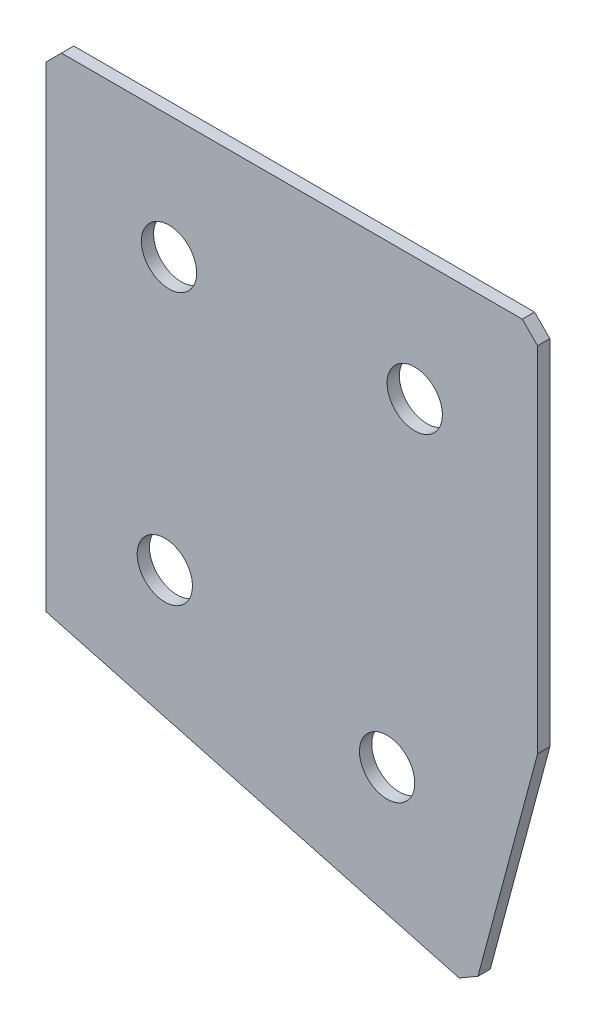
ISO-10303-21;
HEADER;
FILE_DESCRIPTION(('STEP AP214'),'2;1');
FILE_NAME('part.step','',(''),(''),'','','');
FILE_SCHEMA(('AUTOMOTIVE_DESIGN { 1 0 10303 214 1 1 1 1 }'));
ENDSEC;
DATA;
#1=APPLICATION_CONTEXT('core data for automotive mechanical design processes');
#2=APPLICATION_PROTOCOL_DEFINITION('international standard','automotive_design',2000,#1);
#3=PRODUCT_CONTEXT('',#1,'mechanical');
#4=PRODUCT('Part','Part','',(#3));
#5=PRODUCT_RELATED_PRODUCT_CATEGORY('part','',(#4));
#6=PRODUCT_DEFINITION_FORMATION('','',#4);
#7=PRODUCT_DEFINITION_CONTEXT('part definition',#1,'design');
#8=PRODUCT_DEFINITION('design','',#6,#7);
#9=PRODUCT_DEFINITION_SHAPE('','',#8);
#10=(LENGTH_UNIT() NAMED_UNIT(*) SI_UNIT(.MILLI.,.METRE.));
#11=(NAMED_UNIT(*) PLANE_ANGLE_UNIT() SI_UNIT($,.RADIAN.));
#12=(NAMED_UNIT(*) SI_UNIT($,.STERADIAN.) SOLID_ANGLE_UNIT());
#13=UNCERTAINTY_MEASURE_WITH_UNIT(LENGTH_MEASURE(1.E-05),#10,'distance_accuracy_value','');
#14=(GEOMETRIC_REPRESENTATION_CONTEXT(3) GLOBAL_UNCERTAINTY_ASSIGNED_CONTEXT((#13)) GLOBAL_UNIT_ASSIGNED_CONTEXT((#10,
#11,#12)) REPRESENTATION_CONTEXT('',''));
#15=CARTESIAN_POINT('',(0.,0.,0.));
#16=DIRECTION('',(0.,0.,1.));
#17=DIRECTION('',(1.,0.,0.));
#18=AXIS2_PLACEMENT_3D('',#15,#16,#17);
#19=CARTESIAN_POINT('',(0.,0.,-2.));
#20=DIRECTION('',(1.,0.,0.));
#21=DIRECTION('',(0.,0.,-1.));
#22=AXIS2_PLACEMENT_3D('',#19,#20,#21);
#23=PLANE('',#22);
#24=DIRECTION('',(0.,1.,0.));
#25=VECTOR('',#24,1.);
#26=CARTESIAN_POINT('',(0.,0.,0.));
#27=LINE('',#26,#25);
#28=CARTESIAN_POINT('',(0.,-80.,0.));
#29=VERTEX_POINT('',#28);
#30=CARTESIAN_POINT('',(0.,-2.5,0.));
#31=VERTEX_POINT('',#30);
#32=EDGE_CURVE('E130',#29,#31,#27,.T.);
#33=ORIENTED_EDGE('',*,*,#32,.T.);
#34=DIRECTION('',(0.,0.,-1.));
#35=VECTOR('',#34,1.);
#36=CARTESIAN_POINT('',(0.,-2.5,-2.));
#37=LINE('',#36,#35);
#38=CARTESIAN_POINT('',(0.,-2.5,-2.));
#39=VERTEX_POINT('',#38);
#40=EDGE_CURVE('E11',#31,#39,#37,.T.);
#41=ORIENTED_EDGE('',*,*,#40,.T.);
#42=DIRECTION('',(0.,1.,0.));
#43=VECTOR('',#42,1.);
#44=CARTESIAN_POINT('',(0.,0.,-2.));
#45=LINE('',#44,#43);
#46=CARTESIAN_POINT('',(0.,-80.,-2.));
#47=VERTEX_POINT('',#46);
#48=EDGE_CURVE('E141',#47,#39,#45,.T.);
#49=ORIENTED_EDGE('',*,*,#48,.F.);
#50=DIRECTION('',(0.,0.,1.));
#51=VECTOR('',#50,1.);
#52=CARTESIAN_POINT('',(0.,-80.,-2.));
#53=LINE('',#52,#51);
#54=EDGE_CURVE('E120',#47,#29,#53,.T.);
#55=ORIENTED_EDGE('',*,*,#54,.T.);
#56=EDGE_LOOP('',(#33,#41,#49,#55));
#57=FACE_BOUND('',#56,.T.);
#58=ADVANCED_FACE('F37',(#57),#23,.F.);
#59=CARTESIAN_POINT('',(0.,0.,-2.));
#60=DIRECTION('',(0.,-1.,0.));
#61=DIRECTION('',(0.,0.,-1.));
#62=AXIS2_PLACEMENT_3D('',#59,#60,#61);
#63=PLANE('',#62);
#64=DIRECTION('',(1.,0.,0.));
#65=VECTOR('',#64,1.);
#66=CARTESIAN_POINT('',(0.,0.,0.));
#67=LINE('',#66,#65);
#68=CARTESIAN_POINT('',(2.5,0.,0.));
#69=VERTEX_POINT('',#68);
#70=CARTESIAN_POINT('',(77.5,0.,0.));
#71=VERTEX_POINT('',#70);
#72=EDGE_CURVE('E133',#69,#71,#67,.T.);
#73=ORIENTED_EDGE('',*,*,#72,.T.);
#74=DIRECTION('',(0.,0.,-1.));
#75=VECTOR('',#74,1.);
#76=CARTESIAN_POINT('',(77.5,0.,-2.));
#77=LINE('',#76,#75);
#78=CARTESIAN_POINT('',(77.5,0.,-2.));
#79=VERTEX_POINT('',#78);
#80=EDGE_CURVE('E45',#71,#79,#77,.T.);
#81=ORIENTED_EDGE('',*,*,#80,.T.);
#82=DIRECTION('',(1.,0.,0.));
#83=VECTOR('',#82,1.);
#84=CARTESIAN_POINT('',(0.,0.,-2.));
#85=LINE('',#84,#83);
#86=CARTESIAN_POINT('',(2.5,0.,-2.));
#87=VERTEX_POINT('',#86);
#88=EDGE_CURVE('E109',#87,#79,#85,.T.);
#89=ORIENTED_EDGE('',*,*,#88,.F.);
#90=DIRECTION('',(0.,0.,1.));
#91=VECTOR('',#90,1.);
#92=CARTESIAN_POINT('',(2.5,0.,-2.));
#93=LINE('',#92,#91);
#94=EDGE_CURVE('E160',#87,#69,#93,.T.);
#95=ORIENTED_EDGE('',*,*,#94,.T.);
#96=EDGE_LOOP('',(#73,#81,#89,#95));
#97=FACE_BOUND('',#96,.T.);
#98=ADVANCED_FACE('F164',(#97),#63,.F.);
#99=CARTESIAN_POINT('',(80.,0.,-2.));
#100=DIRECTION('',(-1.,0.,0.));
#101=DIRECTION('',(0.,0.,1.));
#102=AXIS2_PLACEMENT_3D('',#99,#100,#101);
#103=PLANE('',#102);
#104=DIRECTION('',(0.,-1.,0.));
#105=VECTOR('',#104,1.);
#106=CARTESIAN_POINT('',(80.,0.,-2.));
#107=LINE('',#106,#105);
#108=CARTESIAN_POINT('',(80.,-2.50000000000003,-2.));
#109=VERTEX_POINT('',#108);
#110=CARTESIAN_POINT('',(80.,-60.0248881780866,-2.));
#111=VERTEX_POINT('',#110);
#112=EDGE_CURVE('E100',#109,#111,#107,.T.);
#113=ORIENTED_EDGE('',*,*,#112,.F.);
#114=DIRECTION('',(0.,0.,1.));
#115=VECTOR('',#114,1.);
#116=CARTESIAN_POINT('',(80.,-2.50000000000003,-2.));
#117=LINE('',#116,#115);
#118=CARTESIAN_POINT('',(80.,-2.50000000000003,0.));
#119=VERTEX_POINT('',#118);
#120=EDGE_CURVE('E158',#109,#119,#117,.T.);
#121=ORIENTED_EDGE('',*,*,#120,.T.);
#122=DIRECTION('',(0.,-1.,0.));
#123=VECTOR('',#122,1.);
#124=CARTESIAN_POINT('',(80.,0.,0.));
#125=LINE('',#124,#123);
#126=CARTESIAN_POINT('',(80.,-60.0248881780866,0.));
#127=VERTEX_POINT('',#126);
#128=EDGE_CURVE('E115',#119,#127,#125,.T.);
#129=ORIENTED_EDGE('',*,*,#128,.T.);
#130=DIRECTION('',(0.,0.,1.));
#131=VECTOR('',#130,1.);
#132=CARTESIAN_POINT('',(80.,-60.0248881780866,-2.));
#133=LINE('',#132,#131);
#134=EDGE_CURVE('E112',#111,#127,#133,.T.);
#135=ORIENTED_EDGE('',*,*,#134,.F.);
#136=EDGE_LOOP('',(#113,#121,#129,#135));
#137=FACE_BOUND('',#136,.T.);
#138=ADVANCED_FACE('F113',(#137),#103,.F.);
#139=CARTESIAN_POINT('',(69.6472381958991,-98.6619212296493,-2.));
#140=DIRECTION('',(-0.965925826289068,0.258819045102522,0.));
#141=DIRECTION('',(-0.258819045102522,-0.965925826289068,0.));
#142=AXIS2_PLACEMENT_3D('',#139,#140,#141);
#143=PLANE('',#142);
#144=DIRECTION('',(-0.258819045102522,-0.965925826289068,0.));
#145=VECTOR('',#144,1.);
#146=CARTESIAN_POINT('',(69.6472381958991,-98.6619212296493,0.));
#147=LINE('',#146,#145);
#148=CARTESIAN_POINT('',(70.2942858086554,-96.2471066639266,0.));
#149=VERTEX_POINT('',#148);
#150=EDGE_CURVE('E137',#127,#149,#147,.T.);
#151=ORIENTED_EDGE('',*,*,#150,.T.);
#152=DIRECTION('',(0.,0.,-1.));
#153=VECTOR('',#152,1.);
#154=CARTESIAN_POINT('',(70.2942858086554,-96.2471066639266,-2.));
#155=LINE('',#154,#153);
#156=CARTESIAN_POINT('',(70.2942858086554,-96.2471066639266,-2.));
#157=VERTEX_POINT('',#156);
#158=EDGE_CURVE('E124',#149,#157,#155,.T.);
#159=ORIENTED_EDGE('',*,*,#158,.T.);
#160=DIRECTION('',(-0.258819045102522,-0.965925826289068,0.));
#161=VECTOR('',#160,1.);
#162=CARTESIAN_POINT('',(69.6472381958991,-98.6619212296493,-2.));
#163=LINE('',#162,#161);
#164=EDGE_CURVE('E104',#111,#157,#163,.T.);
#165=ORIENTED_EDGE('',*,*,#164,.F.);
#166=ORIENTED_EDGE('',*,*,#134,.T.);
#167=EDGE_LOOP('',(#151,#159,#165,#166));
#168=FACE_BOUND('',#167,.T.);
#169=ADVANCED_FACE('F122',(#168),#143,.F.);
#170=CARTESIAN_POINT('',(0.,-80.,-2.));
#171=DIRECTION('',(0.258819045102521,0.965925826289068,0.));
#172=DIRECTION('',(-0.965925826289068,0.258819045102521,0.));
#173=AXIS2_PLACEMENT_3D('',#170,#171,#172);
#174=PLANE('',#173);
#175=DIRECTION('',(-0.965925826289068,0.258819045102521,0.));
#176=VECTOR('',#175,1.);
#177=CARTESIAN_POINT('',(0.,-80.,-2.));
#178=LINE('',#177,#176);
#179=CARTESIAN_POINT('',(67.2324236301764,-98.014873616893,-2.));
#180=VERTEX_POINT('',#179);
#181=EDGE_CURVE('E125',#180,#47,#178,.T.);
#182=ORIENTED_EDGE('',*,*,#181,.F.);
#183=DIRECTION('',(0.,0.,1.));
#184=VECTOR('',#183,1.);
#185=CARTESIAN_POINT('',(67.2324236301764,-98.014873616893,-2.));
#186=LINE('',#185,#184);
#187=CARTESIAN_POINT('',(67.2324236301764,-98.014873616893,0.));
#188=VERTEX_POINT('',#187);
#189=EDGE_CURVE('E119',#180,#188,#186,.T.);
#190=ORIENTED_EDGE('',*,*,#189,.T.);
#191=DIRECTION('',(-0.965925826289068,0.258819045102521,0.));
#192=VECTOR('',#191,1.);
#193=CARTESIAN_POINT('',(0.,-80.,0.));
#194=LINE('',#193,#192);
#195=EDGE_CURVE('E139',#188,#29,#194,.T.);
#196=ORIENTED_EDGE('',*,*,#195,.T.);
#197=ORIENTED_EDGE('',*,*,#54,.F.);
#198=EDGE_LOOP('',(#182,#190,#196,#197));
#199=FACE_BOUND('',#198,.T.);
#200=ADVANCED_FACE('F194',(#199),#174,.F.);
#201=CARTESIAN_POINT('',(0.,0.,-2.));
#202=DIRECTION('',(0.,0.,1.));
#203=DIRECTION('',(1.,0.,0.));
#204=AXIS2_PLACEMENT_3D('',#201,#202,#203);
#205=PLANE('',#204);
#206=CARTESIAN_POINT('',(20.,-20.,-2.));
#207=DIRECTION('',(0.,0.,-1.));
#208=DIRECTION('',(0.,1.,0.));
#209=AXIS2_PLACEMENT_3D('',#206,#207,#208);
#210=CIRCLE('',#209,4.5);
#211=CARTESIAN_POINT('',(20.,-15.5,-2.));
#212=VERTEX_POINT('',#211);
#213=EDGE_CURVE('E226',#212,#212,#210,.T.);
#214=ORIENTED_EDGE('',*,*,#213,.F.);
#215=EDGE_LOOP('',(#214));
#216=FACE_BOUND('',#215,.T.);
#217=CARTESIAN_POINT('',(60.,-20.,-2.));
#218=DIRECTION('',(0.,0.,-1.));
#219=DIRECTION('',(0.,1.,0.));
#220=AXIS2_PLACEMENT_3D('',#217,#218,#219);
#221=CIRCLE('',#220,4.5);
#222=CARTESIAN_POINT('',(60.,-15.5,-2.));
#223=VERTEX_POINT('',#222);
#224=EDGE_CURVE('E228',#223,#223,#221,.T.);
#225=ORIENTED_EDGE('',*,*,#224,.F.);
#226=EDGE_LOOP('',(#225));
#227=FACE_BOUND('',#226,.T.);
#228=CARTESIAN_POINT('',(19.3185165257814,-64.4708572938487,-2.));
#229=DIRECTION('',(0.,0.,-1.));
#230=DIRECTION('',(0.,1.,0.));
#231=AXIS2_PLACEMENT_3D('',#228,#229,#230);
#232=CIRCLE('',#231,4.5);
#233=CARTESIAN_POINT('',(19.3185165257814,-59.9708572938487,-2.));
#234=VERTEX_POINT('',#233);
#235=EDGE_CURVE('E236',#234,#234,#232,.T.);
#236=ORIENTED_EDGE('',*,*,#235,.F.);
#237=EDGE_LOOP('',(#236));
#238=FACE_BOUND('',#237,.T.);
#239=CARTESIAN_POINT('',(55.5051025721682,-74.1670238018175,-2.));
#240=DIRECTION('',(0.,0.,-1.));
#241=DIRECTION('',(0.,1.,0.));
#242=AXIS2_PLACEMENT_3D('',#239,#240,#241);
#243=CIRCLE('',#242,4.5);
#244=CARTESIAN_POINT('',(55.5051025721682,-69.6670238018175,-2.));
#245=VERTEX_POINT('',#244);
#246=EDGE_CURVE('E242',#245,#245,#243,.T.);
#247=ORIENTED_EDGE('',*,*,#246,.F.);
#248=EDGE_LOOP('',(#247));
#249=FACE_BOUND('',#248,.T.);
#250=ORIENTED_EDGE('',*,*,#164,.T.);
#251=DIRECTION('',(0.866025403784439,0.5,0.));
#252=VECTOR('',#251,1.);
#253=CARTESIAN_POINT('',(67.2324236301764,-98.014873616893,-2.));
#254=LINE('',#253,#252);
#255=EDGE_CURVE('E156',#157,#180,#254,.F.);
#256=ORIENTED_EDGE('',*,*,#255,.T.);
#257=ORIENTED_EDGE('',*,*,#181,.T.);
#258=ORIENTED_EDGE('',*,*,#48,.T.);
#259=DIRECTION('',(-0.707106781186548,-0.707106781186548,0.));
#260=VECTOR('',#259,1.);
#261=CARTESIAN_POINT('',(2.5,0.,-2.));
#262=LINE('',#261,#260);
#263=EDGE_CURVE('E153',#39,#87,#262,.F.);
#264=ORIENTED_EDGE('',*,*,#263,.T.);
#265=ORIENTED_EDGE('',*,*,#88,.T.);
#266=DIRECTION('',(-0.707106781186548,0.707106781186548,0.));
#267=VECTOR('',#266,1.);
#268=CARTESIAN_POINT('',(80.,-2.50000000000003,-2.));
#269=LINE('',#268,#267);
#270=EDGE_CURVE('E52',#79,#109,#269,.F.);
#271=ORIENTED_EDGE('',*,*,#270,.T.);
#272=ORIENTED_EDGE('',*,*,#112,.T.);
#273=EDGE_LOOP('',(#250,#256,#257,#258,#264,#265,#271,#272));
#274=FACE_BOUND('',#273,.T.);
#275=ADVANCED_FACE('F102',(#216,#227,#238,#249,#274),#205,.F.);
#276=CARTESIAN_POINT('',(0.,0.,0.));
#277=DIRECTION('',(0.,0.,1.));
#278=DIRECTION('',(1.,0.,0.));
#279=AXIS2_PLACEMENT_3D('',#276,#277,#278);
#280=PLANE('',#279);
#281=CARTESIAN_POINT('',(20.,-20.,0.));
#282=DIRECTION('',(0.,0.,-1.));
#283=DIRECTION('',(0.,1.,0.));
#284=AXIS2_PLACEMENT_3D('',#281,#282,#283);
#285=CIRCLE('',#284,4.5);
#286=CARTESIAN_POINT('',(20.,-15.5,0.));
#287=VERTEX_POINT('',#286);
#288=EDGE_CURVE('E223',#287,#287,#285,.T.);
#289=ORIENTED_EDGE('',*,*,#288,.T.);
#290=EDGE_LOOP('',(#289));
#291=FACE_BOUND('',#290,.T.);
#292=CARTESIAN_POINT('',(60.,-20.,0.));
#293=DIRECTION('',(0.,0.,-1.));
#294=DIRECTION('',(0.,1.,0.));
#295=AXIS2_PLACEMENT_3D('',#292,#293,#294);
#296=CIRCLE('',#295,4.5);
#297=CARTESIAN_POINT('',(60.,-15.5,0.));
#298=VERTEX_POINT('',#297);
#299=EDGE_CURVE('E233',#298,#298,#296,.T.);
#300=ORIENTED_EDGE('',*,*,#299,.T.);
#301=EDGE_LOOP('',(#300));
#302=FACE_BOUND('',#301,.T.);
#303=CARTESIAN_POINT('',(19.3185165257814,-64.4708572938487,0.));
#304=DIRECTION('',(0.,0.,-1.));
#305=DIRECTION('',(0.,1.,0.));
#306=AXIS2_PLACEMENT_3D('',#303,#304,#305);
#307=CIRCLE('',#306,4.5);
#308=CARTESIAN_POINT('',(19.3185165257814,-59.9708572938487,0.));
#309=VERTEX_POINT('',#308);
#310=EDGE_CURVE('E239',#309,#309,#307,.T.);
#311=ORIENTED_EDGE('',*,*,#310,.T.);
#312=EDGE_LOOP('',(#311));
#313=FACE_BOUND('',#312,.T.);
#314=CARTESIAN_POINT('',(55.5051025721682,-74.1670238018175,0.));
#315=DIRECTION('',(0.,0.,-1.));
#316=DIRECTION('',(0.,1.,0.));
#317=AXIS2_PLACEMENT_3D('',#314,#315,#316);
#318=CIRCLE('',#317,4.5);
#319=CARTESIAN_POINT('',(55.5051025721682,-69.6670238018175,0.));
#320=VERTEX_POINT('',#319);
#321=EDGE_CURVE('E134',#320,#320,#318,.T.);
#322=ORIENTED_EDGE('',*,*,#321,.T.);
#323=EDGE_LOOP('',(#322));
#324=FACE_BOUND('',#323,.T.);
#325=ORIENTED_EDGE('',*,*,#195,.F.);
#326=DIRECTION('',(-0.866025403784439,-0.5,0.));
#327=VECTOR('',#326,1.);
#328=CARTESIAN_POINT('',(59.2497911580194,-102.623648623535,0.));
#329=LINE('',#328,#327);
#330=EDGE_CURVE('E150',#188,#149,#329,.F.);
#331=ORIENTED_EDGE('',*,*,#330,.T.);
#332=ORIENTED_EDGE('',*,*,#150,.F.);
#333=ORIENTED_EDGE('',*,*,#128,.F.);
#334=DIRECTION('',(0.707106781186548,-0.707106781186548,0.));
#335=VECTOR('',#334,1.);
#336=CARTESIAN_POINT('',(38.75,38.75,0.));
#337=LINE('',#336,#335);
#338=EDGE_CURVE('E148',#119,#71,#337,.F.);
#339=ORIENTED_EDGE('',*,*,#338,.T.);
#340=ORIENTED_EDGE('',*,*,#72,.F.);
#341=DIRECTION('',(0.707106781186548,0.707106781186548,0.));
#342=VECTOR('',#341,1.);
#343=CARTESIAN_POINT('',(1.25,-1.25,0.));
#344=LINE('',#343,#342);
#345=EDGE_CURVE('E146',#69,#31,#344,.F.);
#346=ORIENTED_EDGE('',*,*,#345,.T.);
#347=ORIENTED_EDGE('',*,*,#32,.F.);
#348=EDGE_LOOP('',(#325,#331,#332,#333,#339,#340,#346,#347));
#349=FACE_BOUND('',#348,.T.);
#350=ADVANCED_FACE('F169',(#291,#302,#313,#324,#349),#280,.T.);
#351=CARTESIAN_POINT('',(55.5051025721682,-74.1670238018175,-2.));
#352=DIRECTION('',(0.,0.,-1.));
#353=DIRECTION('',(0.,1.,0.));
#354=AXIS2_PLACEMENT_3D('',#351,#352,#353);
#355=CYLINDRICAL_SURFACE('',#354,4.5);
#356=ORIENTED_EDGE('',*,*,#321,.F.);
#357=EDGE_LOOP('',(#356));
#358=FACE_BOUND('',#357,.T.);
#359=ORIENTED_EDGE('',*,*,#246,.T.);
#360=EDGE_LOOP('',(#359));
#361=FACE_BOUND('',#360,.T.);
#362=ADVANCED_FACE('F200',(#358,#361),#355,.F.);
#363=CARTESIAN_POINT('',(19.3185165257814,-64.4708572938487,-2.));
#364=DIRECTION('',(0.,0.,-1.));
#365=DIRECTION('',(0.,1.,0.));
#366=AXIS2_PLACEMENT_3D('',#363,#364,#365);
#367=CYLINDRICAL_SURFACE('',#366,4.5);
#368=ORIENTED_EDGE('',*,*,#310,.F.);
#369=EDGE_LOOP('',(#368));
#370=FACE_BOUND('',#369,.T.);
#371=ORIENTED_EDGE('',*,*,#235,.T.);
#372=EDGE_LOOP('',(#371));
#373=FACE_BOUND('',#372,.T.);
#374=ADVANCED_FACE('F207',(#370,#373),#367,.F.);
#375=CARTESIAN_POINT('',(60.,-20.,-2.));
#376=DIRECTION('',(0.,0.,-1.));
#377=DIRECTION('',(0.,1.,0.));
#378=AXIS2_PLACEMENT_3D('',#375,#376,#377);
#379=CYLINDRICAL_SURFACE('',#378,4.5);
#380=ORIENTED_EDGE('',*,*,#299,.F.);
#381=EDGE_LOOP('',(#380));
#382=FACE_BOUND('',#381,.T.);
#383=ORIENTED_EDGE('',*,*,#224,.T.);
#384=EDGE_LOOP('',(#383));
#385=FACE_BOUND('',#384,.T.);
#386=ADVANCED_FACE('F211',(#382,#385),#379,.F.);
#387=CARTESIAN_POINT('',(20.,-20.,-2.));
#388=DIRECTION('',(0.,0.,-1.));
#389=DIRECTION('',(0.,1.,0.));
#390=AXIS2_PLACEMENT_3D('',#387,#388,#389);
#391=CYLINDRICAL_SURFACE('',#390,4.5);
#392=ORIENTED_EDGE('',*,*,#288,.F.);
#393=EDGE_LOOP('',(#392));
#394=FACE_BOUND('',#393,.T.);
#395=ORIENTED_EDGE('',*,*,#213,.T.);
#396=EDGE_LOOP('',(#395));
#397=FACE_BOUND('',#396,.T.);
#398=ADVANCED_FACE('F179',(#394,#397),#391,.F.);
#399=CARTESIAN_POINT('',(67.2324236301764,-98.014873616893,-2.));
#400=DIRECTION('',(-0.5,0.866025403784439,0.));
#401=DIRECTION('',(0.,0.,1.));
#402=AXIS2_PLACEMENT_3D('',#399,#400,#401);
#403=PLANE('',#402);
#404=ORIENTED_EDGE('',*,*,#255,.F.);
#405=ORIENTED_EDGE('',*,*,#158,.F.);
#406=ORIENTED_EDGE('',*,*,#330,.F.);
#407=ORIENTED_EDGE('',*,*,#189,.F.);
#408=EDGE_LOOP('',(#404,#405,#406,#407));
#409=FACE_BOUND('',#408,.T.);
#410=ADVANCED_FACE('F174',(#409),#403,.F.);
#411=CARTESIAN_POINT('',(80.,-2.50000000000003,-2.));
#412=DIRECTION('',(-0.707106781186547,-0.707106781186547,0.));
#413=DIRECTION('',(0.,0.,1.));
#414=AXIS2_PLACEMENT_3D('',#411,#412,#413);
#415=PLANE('',#414);
#416=ORIENTED_EDGE('',*,*,#270,.F.);
#417=ORIENTED_EDGE('',*,*,#80,.F.);
#418=ORIENTED_EDGE('',*,*,#338,.F.);
#419=ORIENTED_EDGE('',*,*,#120,.F.);
#420=EDGE_LOOP('',(#416,#417,#418,#419));
#421=FACE_BOUND('',#420,.T.);
#422=ADVANCED_FACE('F172',(#421),#415,.F.);
#423=CARTESIAN_POINT('',(2.5,0.,-2.));
#424=DIRECTION('',(0.707106781186547,-0.707106781186547,0.));
#425=DIRECTION('',(0.,0.,1.));
#426=AXIS2_PLACEMENT_3D('',#423,#424,#425);
#427=PLANE('',#426);
#428=ORIENTED_EDGE('',*,*,#263,.F.);
#429=ORIENTED_EDGE('',*,*,#40,.F.);
#430=ORIENTED_EDGE('',*,*,#345,.F.);
#431=ORIENTED_EDGE('',*,*,#94,.F.);
#432=EDGE_LOOP('',(#428,#429,#430,#431));
#433=FACE_BOUND('',#432,.T.);
#434=ADVANCED_FACE('F39',(#433),#427,.F.);
#435=CLOSED_SHELL('',(#58,#98,#138,#169,#200,#275,#350,#362,#374,#386,#398,#410,#422,#434));
#436=MANIFOLD_SOLID_BREP('B2',#435);
#437=ADVANCED_BREP_SHAPE_REPRESENTATION('',(#18,#436),#14);
#438=SHAPE_DEFINITION_REPRESENTATION(#9,#437);
ENDSEC;
END-ISO-10303-21;
